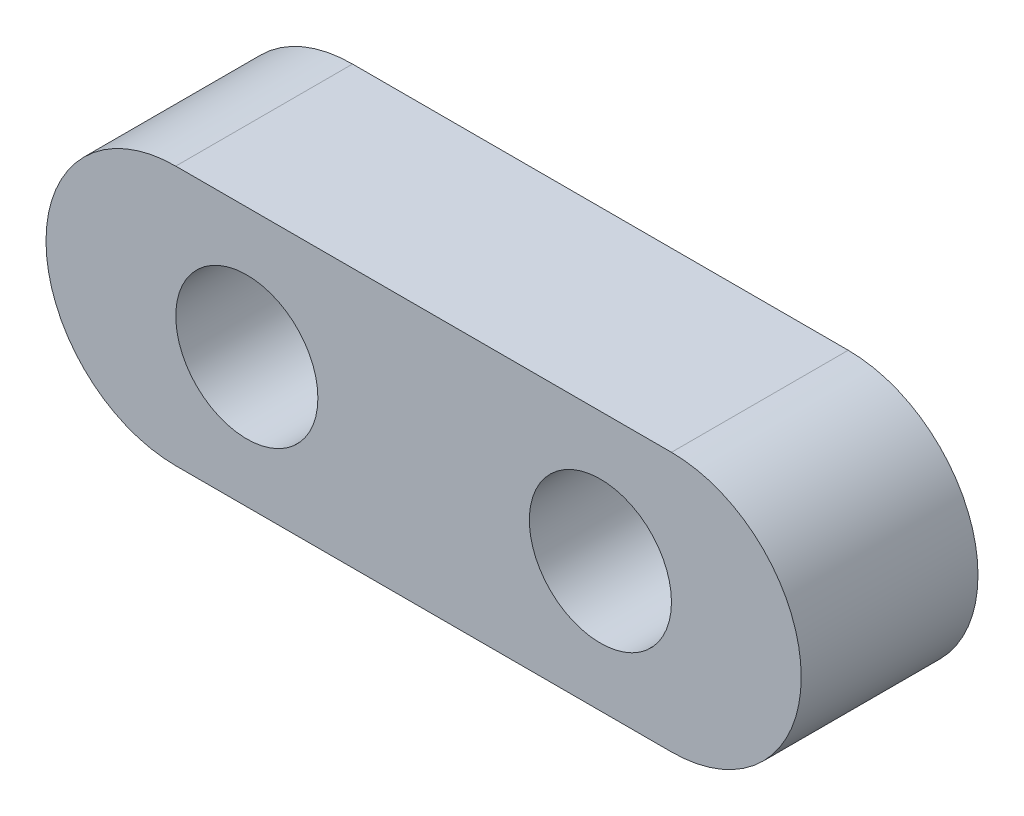
ISO-10303-21;
HEADER;
FILE_DESCRIPTION(('STEP AP214'),'2;1');
FILE_NAME('part.step','',(''),(''),'','','');
FILE_SCHEMA(('AUTOMOTIVE_DESIGN { 1 0 10303 214 1 1 1 1 }'));
ENDSEC;
DATA;
#1=APPLICATION_CONTEXT('core data for automotive mechanical design processes');
#2=APPLICATION_PROTOCOL_DEFINITION('international standard','automotive_design',2000,#1);
#3=PRODUCT_CONTEXT('',#1,'mechanical');
#4=PRODUCT('Part','Part','',(#3));
#5=PRODUCT_RELATED_PRODUCT_CATEGORY('part','',(#4));
#6=PRODUCT_DEFINITION_FORMATION('','',#4);
#7=PRODUCT_DEFINITION_CONTEXT('part definition',#1,'design');
#8=PRODUCT_DEFINITION('design','',#6,#7);
#9=PRODUCT_DEFINITION_SHAPE('','',#8);
#10=(LENGTH_UNIT() NAMED_UNIT(*) SI_UNIT(.MILLI.,.METRE.));
#11=(NAMED_UNIT(*) PLANE_ANGLE_UNIT() SI_UNIT($,.RADIAN.));
#12=(NAMED_UNIT(*) SI_UNIT($,.STERADIAN.) SOLID_ANGLE_UNIT());
#13=UNCERTAINTY_MEASURE_WITH_UNIT(LENGTH_MEASURE(1.E-05),#10,'distance_accuracy_value','');
#14=(GEOMETRIC_REPRESENTATION_CONTEXT(3) GLOBAL_UNCERTAINTY_ASSIGNED_CONTEXT((#13)) GLOBAL_UNIT_ASSIGNED_CONTEXT((#10,
#11,#12)) REPRESENTATION_CONTEXT('',''));
#15=CARTESIAN_POINT('',(0.,0.,0.));
#16=DIRECTION('',(0.,0.,1.));
#17=DIRECTION('',(1.,0.,0.));
#18=AXIS2_PLACEMENT_3D('',#15,#16,#17);
#19=CARTESIAN_POINT('',(8.90270000000003,0.,6.35));
#20=DIRECTION('',(0.,0.,-1.));
#21=DIRECTION('',(-1.,0.,0.));
#22=AXIS2_PLACEMENT_3D('',#19,#20,#21);
#23=CYLINDRICAL_SURFACE('',#22,4.6609);
#24=CARTESIAN_POINT('',(8.90270000000003,0.,0.));
#25=DIRECTION('',(0.,0.,1.));
#26=DIRECTION('',(1.,0.,0.));
#27=AXIS2_PLACEMENT_3D('',#24,#25,#26);
#28=CIRCLE('',#27,4.6609);
#29=CARTESIAN_POINT('',(8.90270000000003,-4.66089999999999,0.));
#30=VERTEX_POINT('',#29);
#31=CARTESIAN_POINT('',(8.90270000000003,4.66090000000002,0.));
#32=VERTEX_POINT('',#31);
#33=EDGE_CURVE('E95',#30,#32,#28,.T.);
#34=ORIENTED_EDGE('',*,*,#33,.T.);
#35=DIRECTION('',(0.,0.,-1.));
#36=VECTOR('',#35,1.);
#37=CARTESIAN_POINT('',(8.90270000000003,4.66090000000002,6.35));
#38=LINE('',#37,#36);
#39=CARTESIAN_POINT('',(8.90270000000003,4.66090000000002,6.35));
#40=VERTEX_POINT('',#39);
#41=EDGE_CURVE('E11',#40,#32,#38,.T.);
#42=ORIENTED_EDGE('',*,*,#41,.F.);
#43=CARTESIAN_POINT('',(8.90270000000003,0.,6.35));
#44=DIRECTION('',(0.,0.,1.));
#45=DIRECTION('',(1.,0.,0.));
#46=AXIS2_PLACEMENT_3D('',#43,#44,#45);
#47=CIRCLE('',#46,4.6609);
#48=CARTESIAN_POINT('',(8.90270000000003,-4.66089999999999,6.35));
#49=VERTEX_POINT('',#48);
#50=EDGE_CURVE('E81',#49,#40,#47,.T.);
#51=ORIENTED_EDGE('',*,*,#50,.F.);
#52=DIRECTION('',(0.,0.,-1.));
#53=VECTOR('',#52,1.);
#54=CARTESIAN_POINT('',(8.90270000000003,-4.66089999999999,6.35));
#55=LINE('',#54,#53);
#56=EDGE_CURVE('E48',#49,#30,#55,.T.);
#57=ORIENTED_EDGE('',*,*,#56,.T.);
#58=EDGE_LOOP('',(#34,#42,#51,#57));
#59=FACE_BOUND('',#58,.T.);
#60=ADVANCED_FACE('F32',(#59),#23,.T.);
#61=CARTESIAN_POINT('',(8.90270000000003,4.66090000000002,6.35));
#62=DIRECTION('',(0.,-1.,0.));
#63=DIRECTION('',(1.,0.,0.));
#64=AXIS2_PLACEMENT_3D('',#61,#62,#63);
#65=PLANE('',#64);
#66=DIRECTION('',(-1.,0.,0.));
#67=VECTOR('',#66,1.);
#68=CARTESIAN_POINT('',(8.90270000000003,4.66090000000002,0.));
#69=LINE('',#68,#67);
#70=CARTESIAN_POINT('',(-8.90270000000003,4.66090000000001,0.));
#71=VERTEX_POINT('',#70);
#72=EDGE_CURVE('E86',#32,#71,#69,.T.);
#73=ORIENTED_EDGE('',*,*,#72,.T.);
#74=DIRECTION('',(0.,0.,-1.));
#75=VECTOR('',#74,1.);
#76=CARTESIAN_POINT('',(-8.90270000000003,4.66090000000001,6.35));
#77=LINE('',#76,#75);
#78=CARTESIAN_POINT('',(-8.90270000000003,4.66090000000001,6.35));
#79=VERTEX_POINT('',#78);
#80=EDGE_CURVE('E40',#79,#71,#77,.T.);
#81=ORIENTED_EDGE('',*,*,#80,.F.);
#82=DIRECTION('',(-1.,0.,0.));
#83=VECTOR('',#82,1.);
#84=CARTESIAN_POINT('',(8.90270000000003,4.66090000000002,6.35));
#85=LINE('',#84,#83);
#86=EDGE_CURVE('E74',#40,#79,#85,.T.);
#87=ORIENTED_EDGE('',*,*,#86,.F.);
#88=ORIENTED_EDGE('',*,*,#41,.T.);
#89=EDGE_LOOP('',(#73,#81,#87,#88));
#90=FACE_BOUND('',#89,.T.);
#91=ADVANCED_FACE('F85',(#90),#65,.F.);
#92=CARTESIAN_POINT('',(-8.90270000000003,0.,6.35));
#93=DIRECTION('',(0.,0.,-1.));
#94=DIRECTION('',(-1.,0.,0.));
#95=AXIS2_PLACEMENT_3D('',#92,#93,#94);
#96=CYLINDRICAL_SURFACE('',#95,4.6609);
#97=CARTESIAN_POINT('',(-8.90270000000003,0.,0.));
#98=DIRECTION('',(0.,0.,1.));
#99=DIRECTION('',(1.,0.,0.));
#100=AXIS2_PLACEMENT_3D('',#97,#98,#99);
#101=CIRCLE('',#100,4.6609);
#102=CARTESIAN_POINT('',(-8.90270000000003,-4.6609,0.));
#103=VERTEX_POINT('',#102);
#104=EDGE_CURVE('E99',#71,#103,#101,.T.);
#105=ORIENTED_EDGE('',*,*,#104,.T.);
#106=DIRECTION('',(0.,0.,-1.));
#107=VECTOR('',#106,1.);
#108=CARTESIAN_POINT('',(-8.90270000000003,-4.6609,6.35));
#109=LINE('',#108,#107);
#110=CARTESIAN_POINT('',(-8.90270000000003,-4.6609,6.35));
#111=VERTEX_POINT('',#110);
#112=EDGE_CURVE('E63',#111,#103,#109,.T.);
#113=ORIENTED_EDGE('',*,*,#112,.F.);
#114=CARTESIAN_POINT('',(-8.90270000000003,0.,6.35));
#115=DIRECTION('',(0.,0.,1.));
#116=DIRECTION('',(1.,0.,0.));
#117=AXIS2_PLACEMENT_3D('',#114,#115,#116);
#118=CIRCLE('',#117,4.6609);
#119=EDGE_CURVE('E80',#79,#111,#118,.T.);
#120=ORIENTED_EDGE('',*,*,#119,.F.);
#121=ORIENTED_EDGE('',*,*,#80,.T.);
#122=EDGE_LOOP('',(#105,#113,#120,#121));
#123=FACE_BOUND('',#122,.T.);
#124=ADVANCED_FACE('F89',(#123),#96,.T.);
#125=CARTESIAN_POINT('',(8.90270000000003,-4.66089999999999,6.35));
#126=DIRECTION('',(0.,-1.,0.));
#127=DIRECTION('',(1.,0.,0.));
#128=AXIS2_PLACEMENT_3D('',#125,#126,#127);
#129=PLANE('',#128);
#130=DIRECTION('',(-1.,0.,0.));
#131=VECTOR('',#130,1.);
#132=CARTESIAN_POINT('',(8.90270000000003,-4.66089999999999,0.));
#133=LINE('',#132,#131);
#134=EDGE_CURVE('E101',#30,#103,#133,.T.);
#135=ORIENTED_EDGE('',*,*,#134,.F.);
#136=ORIENTED_EDGE('',*,*,#56,.F.);
#137=DIRECTION('',(-1.,0.,0.));
#138=VECTOR('',#137,1.);
#139=CARTESIAN_POINT('',(8.90270000000003,-4.66089999999999,6.35));
#140=LINE('',#139,#138);
#141=EDGE_CURVE('E90',#49,#111,#140,.T.);
#142=ORIENTED_EDGE('',*,*,#141,.T.);
#143=ORIENTED_EDGE('',*,*,#112,.T.);
#144=EDGE_LOOP('',(#135,#136,#142,#143));
#145=FACE_BOUND('',#144,.T.);
#146=ADVANCED_FACE('F124',(#145),#129,.T.);
#147=CARTESIAN_POINT('',(8.90270000000003,0.,6.35));
#148=DIRECTION('',(0.,0.,1.));
#149=DIRECTION('',(1.,0.,0.));
#150=AXIS2_PLACEMENT_3D('',#147,#148,#149);
#151=PLANE('',#150);
#152=CARTESIAN_POINT('',(-6.35,0.,6.35));
#153=DIRECTION('',(0.,0.,1.));
#154=DIRECTION('',(1.,0.,0.));
#155=AXIS2_PLACEMENT_3D('',#152,#153,#154);
#156=CIRCLE('',#155,2.5527);
#157=CARTESIAN_POINT('',(-3.7973,0.,6.35));
#158=VERTEX_POINT('',#157);
#159=EDGE_CURVE('E115',#158,#158,#156,.T.);
#160=ORIENTED_EDGE('',*,*,#159,.F.);
#161=EDGE_LOOP('',(#160));
#162=FACE_BOUND('',#161,.T.);
#163=CARTESIAN_POINT('',(6.35,0.,6.35));
#164=DIRECTION('',(0.,0.,1.));
#165=DIRECTION('',(1.,0.,0.));
#166=AXIS2_PLACEMENT_3D('',#163,#164,#165);
#167=CIRCLE('',#166,2.5527);
#168=CARTESIAN_POINT('',(8.9027,0.,6.35));
#169=VERTEX_POINT('',#168);
#170=EDGE_CURVE('E109',#169,#169,#167,.T.);
#171=ORIENTED_EDGE('',*,*,#170,.F.);
#172=EDGE_LOOP('',(#171));
#173=FACE_BOUND('',#172,.T.);
#174=ORIENTED_EDGE('',*,*,#50,.T.);
#175=ORIENTED_EDGE('',*,*,#86,.T.);
#176=ORIENTED_EDGE('',*,*,#119,.T.);
#177=ORIENTED_EDGE('',*,*,#141,.F.);
#178=EDGE_LOOP('',(#174,#175,#176,#177));
#179=FACE_BOUND('',#178,.T.);
#180=ADVANCED_FACE('F77',(#162,#173,#179),#151,.T.);
#181=CARTESIAN_POINT('',(8.90270000000003,0.,0.));
#182=DIRECTION('',(0.,0.,1.));
#183=DIRECTION('',(1.,0.,0.));
#184=AXIS2_PLACEMENT_3D('',#181,#182,#183);
#185=PLANE('',#184);
#186=CARTESIAN_POINT('',(-6.35,0.,0.));
#187=DIRECTION('',(0.,0.,1.));
#188=DIRECTION('',(1.,0.,0.));
#189=AXIS2_PLACEMENT_3D('',#186,#187,#188);
#190=CIRCLE('',#189,2.5527);
#191=CARTESIAN_POINT('',(-3.7973,0.,0.));
#192=VERTEX_POINT('',#191);
#193=EDGE_CURVE('E112',#192,#192,#190,.T.);
#194=ORIENTED_EDGE('',*,*,#193,.T.);
#195=EDGE_LOOP('',(#194));
#196=FACE_BOUND('',#195,.T.);
#197=CARTESIAN_POINT('',(6.35,0.,0.));
#198=DIRECTION('',(0.,0.,1.));
#199=DIRECTION('',(1.,0.,0.));
#200=AXIS2_PLACEMENT_3D('',#197,#198,#199);
#201=CIRCLE('',#200,2.5527);
#202=CARTESIAN_POINT('',(8.9027,0.,0.));
#203=VERTEX_POINT('',#202);
#204=EDGE_CURVE('E97',#203,#203,#201,.T.);
#205=ORIENTED_EDGE('',*,*,#204,.T.);
#206=EDGE_LOOP('',(#205));
#207=FACE_BOUND('',#206,.T.);
#208=ORIENTED_EDGE('',*,*,#33,.F.);
#209=ORIENTED_EDGE('',*,*,#134,.T.);
#210=ORIENTED_EDGE('',*,*,#104,.F.);
#211=ORIENTED_EDGE('',*,*,#72,.F.);
#212=EDGE_LOOP('',(#208,#209,#210,#211));
#213=FACE_BOUND('',#212,.T.);
#214=ADVANCED_FACE('F123',(#196,#207,#213),#185,.F.);
#215=CARTESIAN_POINT('',(6.35,0.,6.35));
#216=DIRECTION('',(0.,0.,1.));
#217=DIRECTION('',(1.,0.,0.));
#218=AXIS2_PLACEMENT_3D('',#215,#216,#217);
#219=CYLINDRICAL_SURFACE('',#218,2.5527);
#220=ORIENTED_EDGE('',*,*,#204,.F.);
#221=EDGE_LOOP('',(#220));
#222=FACE_BOUND('',#221,.T.);
#223=ORIENTED_EDGE('',*,*,#170,.T.);
#224=EDGE_LOOP('',(#223));
#225=FACE_BOUND('',#224,.T.);
#226=ADVANCED_FACE('F128',(#222,#225),#219,.F.);
#227=CARTESIAN_POINT('',(-6.35,0.,6.35));
#228=DIRECTION('',(0.,0.,1.));
#229=DIRECTION('',(1.,0.,0.));
#230=AXIS2_PLACEMENT_3D('',#227,#228,#229);
#231=CYLINDRICAL_SURFACE('',#230,2.5527);
#232=ORIENTED_EDGE('',*,*,#193,.F.);
#233=EDGE_LOOP('',(#232));
#234=FACE_BOUND('',#233,.T.);
#235=ORIENTED_EDGE('',*,*,#159,.T.);
#236=EDGE_LOOP('',(#235));
#237=FACE_BOUND('',#236,.T.);
#238=ADVANCED_FACE('F119',(#234,#237),#231,.F.);
#239=CLOSED_SHELL('',(#60,#91,#124,#146,#180,#214,#226,#238));
#240=MANIFOLD_SOLID_BREP('B2',#239);
#241=ADVANCED_BREP_SHAPE_REPRESENTATION('',(#18,#240),#14);
#242=SHAPE_DEFINITION_REPRESENTATION(#9,#241);
ENDSEC;
END-ISO-10303-21;
